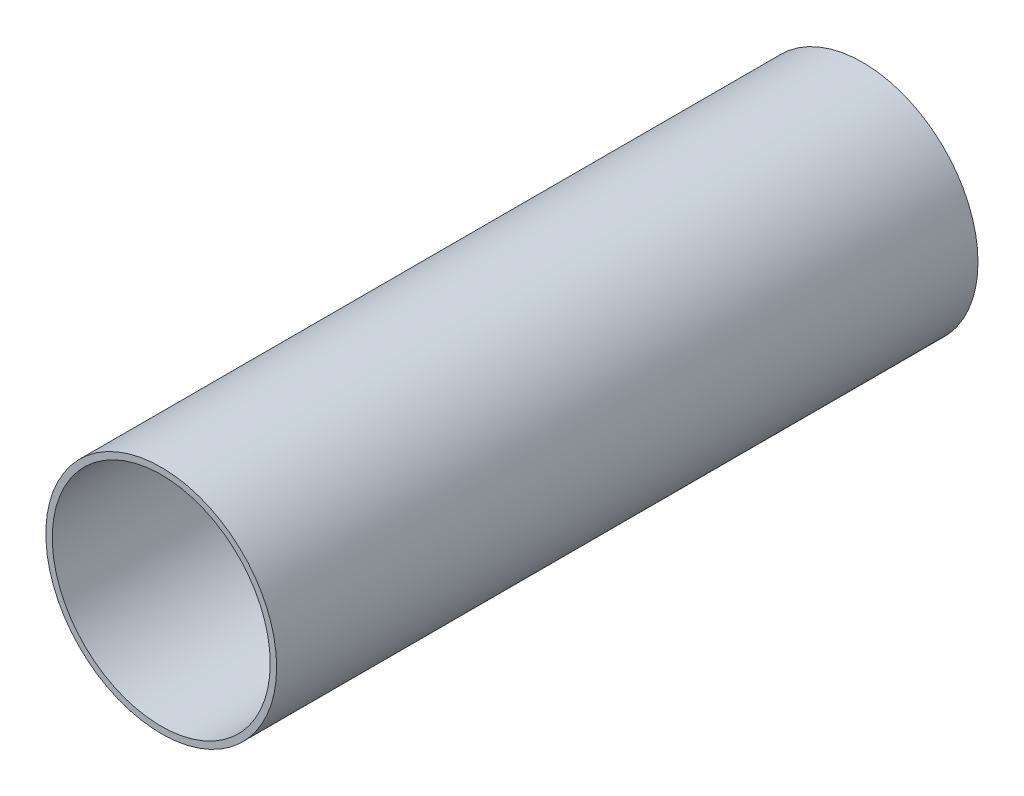
ISO-10303-21;
HEADER;
FILE_DESCRIPTION(('STEP AP214'),'2;1');
FILE_NAME('part.step','',(''),(''),'','','');
FILE_SCHEMA(('AUTOMOTIVE_DESIGN { 1 0 10303 214 1 1 1 1 }'));
ENDSEC;
DATA;
#1=APPLICATION_CONTEXT('core data for automotive mechanical design processes');
#2=APPLICATION_PROTOCOL_DEFINITION('international standard','automotive_design',2000,#1);
#3=PRODUCT_CONTEXT('',#1,'mechanical');
#4=PRODUCT('Part','Part','',(#3));
#5=PRODUCT_RELATED_PRODUCT_CATEGORY('part','',(#4));
#6=PRODUCT_DEFINITION_FORMATION('','',#4);
#7=PRODUCT_DEFINITION_CONTEXT('part definition',#1,'design');
#8=PRODUCT_DEFINITION('design','',#6,#7);
#9=PRODUCT_DEFINITION_SHAPE('','',#8);
#10=(LENGTH_UNIT() NAMED_UNIT(*) SI_UNIT(.MILLI.,.METRE.));
#11=(NAMED_UNIT(*) PLANE_ANGLE_UNIT() SI_UNIT($,.RADIAN.));
#12=(NAMED_UNIT(*) SI_UNIT($,.STERADIAN.) SOLID_ANGLE_UNIT());
#13=UNCERTAINTY_MEASURE_WITH_UNIT(LENGTH_MEASURE(1.E-05),#10,'distance_accuracy_value','');
#14=(GEOMETRIC_REPRESENTATION_CONTEXT(3) GLOBAL_UNCERTAINTY_ASSIGNED_CONTEXT((#13)) GLOBAL_UNIT_ASSIGNED_CONTEXT((#10,
#11,#12)) REPRESENTATION_CONTEXT('',''));
#15=CARTESIAN_POINT('',(0.,0.,0.));
#16=DIRECTION('',(0.,0.,1.));
#17=DIRECTION('',(1.,0.,0.));
#18=AXIS2_PLACEMENT_3D('',#15,#16,#17);
#19=CARTESIAN_POINT('',(0.,0.,13.675));
#20=DIRECTION('',(0.,0.,1.));
#21=DIRECTION('',(1.,0.,0.));
#22=AXIS2_PLACEMENT_3D('',#19,#20,#21);
#23=PLANE('',#22);
#24=CARTESIAN_POINT('',(0.,0.,13.675));
#25=DIRECTION('',(0.,0.,1.));
#26=DIRECTION('',(1.,0.,0.));
#27=AXIS2_PLACEMENT_3D('',#24,#25,#26);
#28=CIRCLE('',#27,2.25);
#29=CARTESIAN_POINT('',(2.25,0.,13.675));
#30=VERTEX_POINT('',#29);
#31=EDGE_CURVE('E10',#30,#30,#28,.T.);
#32=ORIENTED_EDGE('',*,*,#31,.T.);
#33=EDGE_LOOP('',(#32));
#34=FACE_BOUND('',#33,.T.);
#35=CARTESIAN_POINT('',(0.,0.,13.675));
#36=DIRECTION('',(0.,0.,1.));
#37=DIRECTION('',(1.,0.,0.));
#38=AXIS2_PLACEMENT_3D('',#35,#36,#37);
#39=CIRCLE('',#38,2.125);
#40=CARTESIAN_POINT('',(2.125,0.,13.675));
#41=VERTEX_POINT('',#40);
#42=EDGE_CURVE('E48',#41,#41,#39,.T.);
#43=ORIENTED_EDGE('',*,*,#42,.F.);
#44=EDGE_LOOP('',(#43));
#45=FACE_BOUND('',#44,.T.);
#46=ADVANCED_FACE('F37',(#34,#45),#23,.T.);
#47=CARTESIAN_POINT('',(0.,0.,0.));
#48=DIRECTION('',(0.,0.,1.));
#49=DIRECTION('',(1.,0.,0.));
#50=AXIS2_PLACEMENT_3D('',#47,#48,#49);
#51=PLANE('',#50);
#52=CARTESIAN_POINT('',(0.,0.,0.));
#53=DIRECTION('',(0.,0.,1.));
#54=DIRECTION('',(1.,0.,0.));
#55=AXIS2_PLACEMENT_3D('',#52,#53,#54);
#56=CIRCLE('',#55,2.25);
#57=CARTESIAN_POINT('',(2.25,0.,0.));
#58=VERTEX_POINT('',#57);
#59=EDGE_CURVE('E41',#58,#58,#56,.T.);
#60=ORIENTED_EDGE('',*,*,#59,.F.);
#61=EDGE_LOOP('',(#60));
#62=FACE_BOUND('',#61,.T.);
#63=CARTESIAN_POINT('',(0.,0.,0.));
#64=DIRECTION('',(0.,0.,1.));
#65=DIRECTION('',(1.,0.,0.));
#66=AXIS2_PLACEMENT_3D('',#63,#64,#65);
#67=CIRCLE('',#66,2.125);
#68=CARTESIAN_POINT('',(2.125,0.,0.));
#69=VERTEX_POINT('',#68);
#70=EDGE_CURVE('E50',#69,#69,#67,.T.);
#71=ORIENTED_EDGE('',*,*,#70,.T.);
#72=EDGE_LOOP('',(#71));
#73=FACE_BOUND('',#72,.T.);
#74=ADVANCED_FACE('F60',(#62,#73),#51,.F.);
#75=CARTESIAN_POINT('',(0.,0.,13.675));
#76=DIRECTION('',(0.,0.,-1.));
#77=DIRECTION('',(-1.,0.,0.));
#78=AXIS2_PLACEMENT_3D('',#75,#76,#77);
#79=CYLINDRICAL_SURFACE('',#78,2.25);
#80=ORIENTED_EDGE('',*,*,#31,.F.);
#81=EDGE_LOOP('',(#80));
#82=FACE_BOUND('',#81,.T.);
#83=ORIENTED_EDGE('',*,*,#59,.T.);
#84=EDGE_LOOP('',(#83));
#85=FACE_BOUND('',#84,.T.);
#86=ADVANCED_FACE('F39',(#82,#85),#79,.T.);
#87=CARTESIAN_POINT('',(0.,0.,13.675));
#88=DIRECTION('',(0.,0.,-1.));
#89=DIRECTION('',(-1.,0.,0.));
#90=AXIS2_PLACEMENT_3D('',#87,#88,#89);
#91=CYLINDRICAL_SURFACE('',#90,2.125);
#92=ORIENTED_EDGE('',*,*,#42,.T.);
#93=EDGE_LOOP('',(#92));
#94=FACE_BOUND('',#93,.T.);
#95=ORIENTED_EDGE('',*,*,#70,.F.);
#96=EDGE_LOOP('',(#95));
#97=FACE_BOUND('',#96,.T.);
#98=ADVANCED_FACE('F56',(#94,#97),#91,.F.);
#99=CLOSED_SHELL('',(#46,#74,#86,#98));
#100=MANIFOLD_SOLID_BREP('B2',#99);
#101=ADVANCED_BREP_SHAPE_REPRESENTATION('',(#18,#100),#14);
#102=SHAPE_DEFINITION_REPRESENTATION(#9,#101);
ENDSEC;
END-ISO-10303-21;
